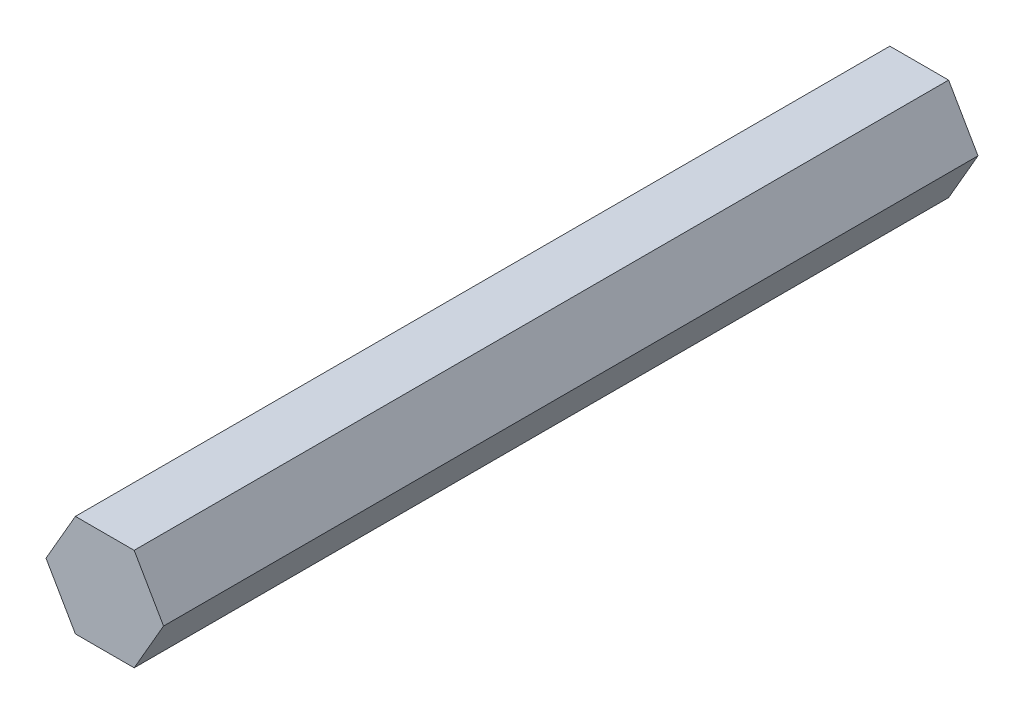
ISO-10303-21;
HEADER;
FILE_DESCRIPTION(('STEP AP214'),'2;1');
FILE_NAME('part.step','',(''),(''),'','','');
FILE_SCHEMA(('AUTOMOTIVE_DESIGN { 1 0 10303 214 1 1 1 1 }'));
ENDSEC;
DATA;
#1=APPLICATION_CONTEXT('core data for automotive mechanical design processes');
#2=APPLICATION_PROTOCOL_DEFINITION('international standard','automotive_design',2000,#1);
#3=PRODUCT_CONTEXT('',#1,'mechanical');
#4=PRODUCT('Part','Part','',(#3));
#5=PRODUCT_RELATED_PRODUCT_CATEGORY('part','',(#4));
#6=PRODUCT_DEFINITION_FORMATION('','',#4);
#7=PRODUCT_DEFINITION_CONTEXT('part definition',#1,'design');
#8=PRODUCT_DEFINITION('design','',#6,#7);
#9=PRODUCT_DEFINITION_SHAPE('','',#8);
#10=(LENGTH_UNIT() NAMED_UNIT(*) SI_UNIT(.MILLI.,.METRE.));
#11=(NAMED_UNIT(*) PLANE_ANGLE_UNIT() SI_UNIT($,.RADIAN.));
#12=(NAMED_UNIT(*) SI_UNIT($,.STERADIAN.) SOLID_ANGLE_UNIT());
#13=UNCERTAINTY_MEASURE_WITH_UNIT(LENGTH_MEASURE(1.E-05),#10,'distance_accuracy_value','');
#14=(GEOMETRIC_REPRESENTATION_CONTEXT(3) GLOBAL_UNCERTAINTY_ASSIGNED_CONTEXT((#13)) GLOBAL_UNIT_ASSIGNED_CONTEXT((#10,
#11,#12)) REPRESENTATION_CONTEXT('',''));
#15=CARTESIAN_POINT('',(0.,0.,0.));
#16=DIRECTION('',(0.,0.,1.));
#17=DIRECTION('',(1.,0.,0.));
#18=AXIS2_PLACEMENT_3D('',#15,#16,#17);
#19=CARTESIAN_POINT('',(3.6661742093542,-6.34999999999996,101.6));
#20=DIRECTION('',(-0.866025403784442,0.499999999999995,0.));
#21=DIRECTION('',(-0.499999999999995,-0.866025403784442,0.));
#22=AXIS2_PLACEMENT_3D('',#19,#20,#21);
#23=PLANE('',#22);
#24=DIRECTION('',(0.499999999999995,0.866025403784442,0.));
#25=VECTOR('',#24,1.);
#26=CARTESIAN_POINT('',(3.6661742093542,-6.34999999999996,0.));
#27=LINE('',#26,#25);
#28=CARTESIAN_POINT('',(3.6661742093542,-6.34999999999996,0.));
#29=VERTEX_POINT('',#28);
#30=CARTESIAN_POINT('',(7.33234841870825,0.,0.));
#31=VERTEX_POINT('',#30);
#32=EDGE_CURVE('E117',#29,#31,#27,.T.);
#33=ORIENTED_EDGE('',*,*,#32,.T.);
#34=DIRECTION('',(0.,0.,-1.));
#35=VECTOR('',#34,1.);
#36=CARTESIAN_POINT('',(7.33234841870825,0.,101.6));
#37=LINE('',#36,#35);
#38=CARTESIAN_POINT('',(7.33234841870825,0.,101.6));
#39=VERTEX_POINT('',#38);
#40=EDGE_CURVE('E11',#39,#31,#37,.T.);
#41=ORIENTED_EDGE('',*,*,#40,.F.);
#42=DIRECTION('',(0.499999999999995,0.866025403784442,0.));
#43=VECTOR('',#42,1.);
#44=CARTESIAN_POINT('',(3.6661742093542,-6.34999999999996,101.6));
#45=LINE('',#44,#43);
#46=CARTESIAN_POINT('',(3.6661742093542,-6.34999999999996,101.6));
#47=VERTEX_POINT('',#46);
#48=EDGE_CURVE('E127',#47,#39,#45,.T.);
#49=ORIENTED_EDGE('',*,*,#48,.F.);
#50=DIRECTION('',(0.,0.,-1.));
#51=VECTOR('',#50,1.);
#52=CARTESIAN_POINT('',(3.6661742093542,-6.34999999999996,101.6));
#53=LINE('',#52,#51);
#54=EDGE_CURVE('E113',#47,#29,#53,.T.);
#55=ORIENTED_EDGE('',*,*,#54,.T.);
#56=EDGE_LOOP('',(#33,#41,#49,#55));
#57=FACE_BOUND('',#56,.T.);
#58=ADVANCED_FACE('F33',(#57),#23,.F.);
#59=CARTESIAN_POINT('',(7.33234841870825,0.,101.6));
#60=DIRECTION('',(-0.866025403784438,-0.500000000000001,0.));
#61=DIRECTION('',(0.500000000000001,-0.866025403784438,0.));
#62=AXIS2_PLACEMENT_3D('',#59,#60,#61);
#63=PLANE('',#62);
#64=DIRECTION('',(-0.500000000000001,0.866025403784438,0.));
#65=VECTOR('',#64,1.);
#66=CARTESIAN_POINT('',(7.33234841870825,0.,0.));
#67=LINE('',#66,#65);
#68=CARTESIAN_POINT('',(3.66617420935411,6.35000000000001,0.));
#69=VERTEX_POINT('',#68);
#70=EDGE_CURVE('E120',#31,#69,#67,.T.);
#71=ORIENTED_EDGE('',*,*,#70,.T.);
#72=DIRECTION('',(0.,0.,-1.));
#73=VECTOR('',#72,1.);
#74=CARTESIAN_POINT('',(3.66617420935411,6.35000000000001,101.6));
#75=LINE('',#74,#73);
#76=CARTESIAN_POINT('',(3.66617420935411,6.35000000000001,101.6));
#77=VERTEX_POINT('',#76);
#78=EDGE_CURVE('E41',#77,#69,#75,.T.);
#79=ORIENTED_EDGE('',*,*,#78,.F.);
#80=DIRECTION('',(-0.500000000000001,0.866025403784438,0.));
#81=VECTOR('',#80,1.);
#82=CARTESIAN_POINT('',(7.33234841870825,0.,101.6));
#83=LINE('',#82,#81);
#84=EDGE_CURVE('E86',#39,#77,#83,.T.);
#85=ORIENTED_EDGE('',*,*,#84,.F.);
#86=ORIENTED_EDGE('',*,*,#40,.T.);
#87=EDGE_LOOP('',(#71,#79,#85,#86));
#88=FACE_BOUND('',#87,.T.);
#89=ADVANCED_FACE('F151',(#88),#63,.F.);
#90=CARTESIAN_POINT('',(3.66617420935411,6.35000000000001,101.6));
#91=DIRECTION('',(0.,-1.,0.));
#92=DIRECTION('',(1.,0.,0.));
#93=AXIS2_PLACEMENT_3D('',#90,#91,#92);
#94=PLANE('',#93);
#95=DIRECTION('',(-1.,0.,0.));
#96=VECTOR('',#95,1.);
#97=CARTESIAN_POINT('',(3.66617420935411,6.35000000000001,0.));
#98=LINE('',#97,#96);
#99=CARTESIAN_POINT('',(-3.66617420935416,6.34999999999999,0.));
#100=VERTEX_POINT('',#99);
#101=EDGE_CURVE('E122',#69,#100,#98,.T.);
#102=ORIENTED_EDGE('',*,*,#101,.T.);
#103=DIRECTION('',(0.,0.,-1.));
#104=VECTOR('',#103,1.);
#105=CARTESIAN_POINT('',(-3.66617420935416,6.34999999999999,101.6));
#106=LINE('',#105,#104);
#107=CARTESIAN_POINT('',(-3.66617420935416,6.34999999999999,101.6));
#108=VERTEX_POINT('',#107);
#109=EDGE_CURVE('E108',#108,#100,#106,.T.);
#110=ORIENTED_EDGE('',*,*,#109,.F.);
#111=DIRECTION('',(-1.,0.,0.));
#112=VECTOR('',#111,1.);
#113=CARTESIAN_POINT('',(3.66617420935411,6.35000000000001,101.6));
#114=LINE('',#113,#112);
#115=EDGE_CURVE('E99',#77,#108,#114,.T.);
#116=ORIENTED_EDGE('',*,*,#115,.F.);
#117=ORIENTED_EDGE('',*,*,#78,.T.);
#118=EDGE_LOOP('',(#102,#110,#116,#117));
#119=FACE_BOUND('',#118,.T.);
#120=ADVANCED_FACE('F133',(#119),#94,.F.);
#121=CARTESIAN_POINT('',(-3.66617420935416,6.34999999999999,101.6));
#122=DIRECTION('',(0.866025403784442,-0.499999999999995,0.));
#123=DIRECTION('',(0.499999999999995,0.866025403784442,0.));
#124=AXIS2_PLACEMENT_3D('',#121,#122,#123);
#125=PLANE('',#124);
#126=DIRECTION('',(-0.499999999999995,-0.866025403784442,0.));
#127=VECTOR('',#126,1.);
#128=CARTESIAN_POINT('',(-3.66617420935416,6.34999999999999,0.));
#129=LINE('',#128,#127);
#130=CARTESIAN_POINT('',(-7.33234841870825,0.,0.));
#131=VERTEX_POINT('',#130);
#132=EDGE_CURVE('E107',#100,#131,#129,.T.);
#133=ORIENTED_EDGE('',*,*,#132,.T.);
#134=DIRECTION('',(0.,0.,-1.));
#135=VECTOR('',#134,1.);
#136=CARTESIAN_POINT('',(-7.33234841870825,0.,101.6));
#137=LINE('',#136,#135);
#138=CARTESIAN_POINT('',(-7.33234841870825,0.,101.6));
#139=VERTEX_POINT('',#138);
#140=EDGE_CURVE('E104',#139,#131,#137,.T.);
#141=ORIENTED_EDGE('',*,*,#140,.F.);
#142=DIRECTION('',(-0.499999999999995,-0.866025403784442,0.));
#143=VECTOR('',#142,1.);
#144=CARTESIAN_POINT('',(-3.66617420935416,6.34999999999999,101.6));
#145=LINE('',#144,#143);
#146=EDGE_CURVE('E93',#108,#139,#145,.T.);
#147=ORIENTED_EDGE('',*,*,#146,.F.);
#148=ORIENTED_EDGE('',*,*,#109,.T.);
#149=EDGE_LOOP('',(#133,#141,#147,#148));
#150=FACE_BOUND('',#149,.T.);
#151=ADVANCED_FACE('F105',(#150),#125,.F.);
#152=CARTESIAN_POINT('',(-7.33234841870825,0.,101.6));
#153=DIRECTION('',(0.866025403784435,0.500000000000007,0.));
#154=DIRECTION('',(-0.500000000000007,0.866025403784435,0.));
#155=AXIS2_PLACEMENT_3D('',#152,#153,#154);
#156=PLANE('',#155);
#157=DIRECTION('',(0.500000000000007,-0.866025403784435,0.));
#158=VECTOR('',#157,1.);
#159=CARTESIAN_POINT('',(-7.33234841870825,0.,0.));
#160=LINE('',#159,#158);
#161=CARTESIAN_POINT('',(-3.66617420935407,-6.35000000000004,0.));
#162=VERTEX_POINT('',#161);
#163=EDGE_CURVE('E72',#131,#162,#160,.T.);
#164=ORIENTED_EDGE('',*,*,#163,.T.);
#165=DIRECTION('',(0.,0.,-1.));
#166=VECTOR('',#165,1.);
#167=CARTESIAN_POINT('',(-3.66617420935407,-6.35000000000004,101.6));
#168=LINE('',#167,#166);
#169=CARTESIAN_POINT('',(-3.66617420935407,-6.35000000000004,101.6));
#170=VERTEX_POINT('',#169);
#171=EDGE_CURVE('E109',#170,#162,#168,.T.);
#172=ORIENTED_EDGE('',*,*,#171,.F.);
#173=DIRECTION('',(0.500000000000007,-0.866025403784435,0.));
#174=VECTOR('',#173,1.);
#175=CARTESIAN_POINT('',(-7.33234841870825,0.,101.6));
#176=LINE('',#175,#174);
#177=EDGE_CURVE('E97',#139,#170,#176,.T.);
#178=ORIENTED_EDGE('',*,*,#177,.F.);
#179=ORIENTED_EDGE('',*,*,#140,.T.);
#180=EDGE_LOOP('',(#164,#172,#178,#179));
#181=FACE_BOUND('',#180,.T.);
#182=ADVANCED_FACE('F111',(#181),#156,.F.);
#183=CARTESIAN_POINT('',(-3.66617420935407,-6.35000000000004,101.6));
#184=DIRECTION('',(0.,1.,0.));
#185=DIRECTION('',(-1.,0.,0.));
#186=AXIS2_PLACEMENT_3D('',#183,#184,#185);
#187=PLANE('',#186);
#188=DIRECTION('',(1.,0.,0.));
#189=VECTOR('',#188,1.);
#190=CARTESIAN_POINT('',(-3.66617420935407,-6.35000000000004,0.));
#191=LINE('',#190,#189);
#192=EDGE_CURVE('E78',#162,#29,#191,.T.);
#193=ORIENTED_EDGE('',*,*,#192,.T.);
#194=ORIENTED_EDGE('',*,*,#54,.F.);
#195=DIRECTION('',(1.,0.,0.));
#196=VECTOR('',#195,1.);
#197=CARTESIAN_POINT('',(-3.66617420935407,-6.35000000000004,101.6));
#198=LINE('',#197,#196);
#199=EDGE_CURVE('E49',#170,#47,#198,.T.);
#200=ORIENTED_EDGE('',*,*,#199,.F.);
#201=ORIENTED_EDGE('',*,*,#171,.T.);
#202=EDGE_LOOP('',(#193,#194,#200,#201));
#203=FACE_BOUND('',#202,.T.);
#204=ADVANCED_FACE('F140',(#203),#187,.F.);
#205=CARTESIAN_POINT('',(0.,0.,101.6));
#206=DIRECTION('',(0.,0.,1.));
#207=DIRECTION('',(1.,0.,0.));
#208=AXIS2_PLACEMENT_3D('',#205,#206,#207);
#209=PLANE('',#208);
#210=ORIENTED_EDGE('',*,*,#48,.T.);
#211=ORIENTED_EDGE('',*,*,#84,.T.);
#212=ORIENTED_EDGE('',*,*,#115,.T.);
#213=ORIENTED_EDGE('',*,*,#146,.T.);
#214=ORIENTED_EDGE('',*,*,#177,.T.);
#215=ORIENTED_EDGE('',*,*,#199,.T.);
#216=EDGE_LOOP('',(#210,#211,#212,#213,#214,#215));
#217=FACE_BOUND('',#216,.T.);
#218=ADVANCED_FACE('F95',(#217),#209,.T.);
#219=CARTESIAN_POINT('',(0.,0.,0.));
#220=DIRECTION('',(0.,0.,1.));
#221=DIRECTION('',(1.,0.,0.));
#222=AXIS2_PLACEMENT_3D('',#219,#220,#221);
#223=PLANE('',#222);
#224=ORIENTED_EDGE('',*,*,#32,.F.);
#225=ORIENTED_EDGE('',*,*,#192,.F.);
#226=ORIENTED_EDGE('',*,*,#163,.F.);
#227=ORIENTED_EDGE('',*,*,#132,.F.);
#228=ORIENTED_EDGE('',*,*,#101,.F.);
#229=ORIENTED_EDGE('',*,*,#70,.F.);
#230=EDGE_LOOP('',(#224,#225,#226,#227,#228,#229));
#231=FACE_BOUND('',#230,.T.);
#232=ADVANCED_FACE('F136',(#231),#223,.F.);
#233=CLOSED_SHELL('',(#58,#89,#120,#151,#182,#204,#218,#232));
#234=MANIFOLD_SOLID_BREP('B2',#233);
#235=ADVANCED_BREP_SHAPE_REPRESENTATION('',(#18,#234),#14);
#236=SHAPE_DEFINITION_REPRESENTATION(#9,#235);
ENDSEC;
END-ISO-10303-21;
